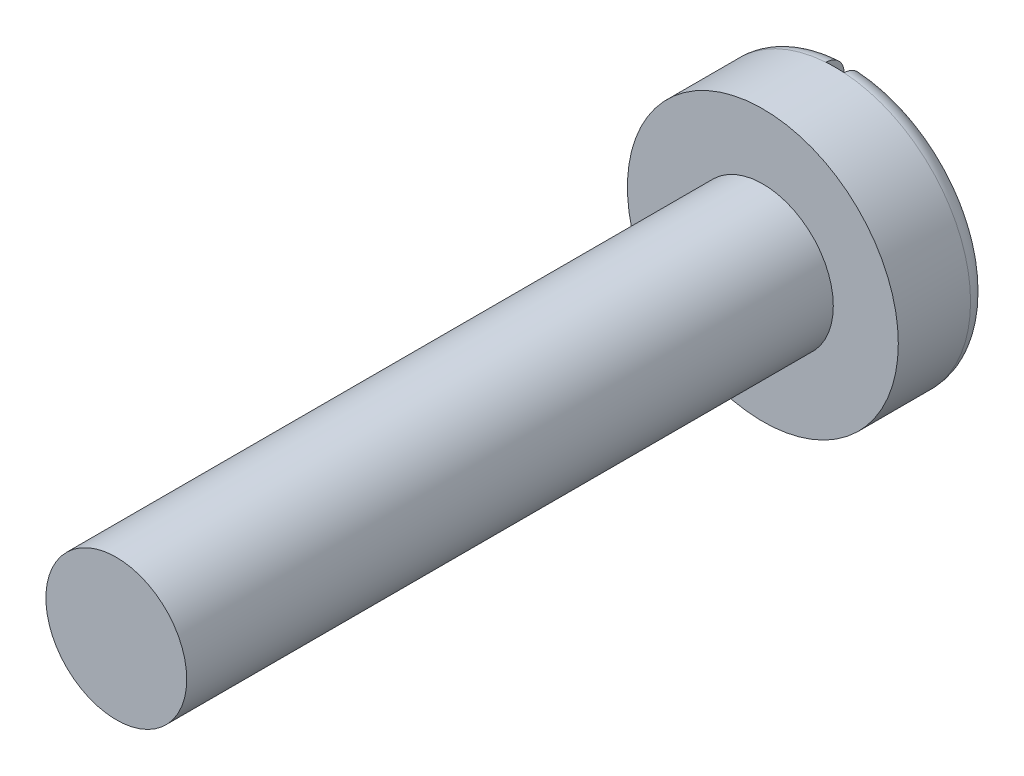
ISO-10303-21;
HEADER;
FILE_DESCRIPTION(('STEP AP214'),'2;1');
FILE_NAME('part.step','',(''),(''),'','','');
FILE_SCHEMA(('AUTOMOTIVE_DESIGN { 1 0 10303 214 1 1 1 1 }'));
ENDSEC;
DATA;
#1=APPLICATION_CONTEXT('core data for automotive mechanical design processes');
#2=APPLICATION_PROTOCOL_DEFINITION('international standard','automotive_design',2000,#1);
#3=PRODUCT_CONTEXT('',#1,'mechanical');
#4=PRODUCT('Part','Part','',(#3));
#5=PRODUCT_RELATED_PRODUCT_CATEGORY('part','',(#4));
#6=PRODUCT_DEFINITION_FORMATION('','',#4);
#7=PRODUCT_DEFINITION_CONTEXT('part definition',#1,'design');
#8=PRODUCT_DEFINITION('design','',#6,#7);
#9=PRODUCT_DEFINITION_SHAPE('','',#8);
#10=(LENGTH_UNIT() NAMED_UNIT(*) SI_UNIT(.MILLI.,.METRE.));
#11=(NAMED_UNIT(*) PLANE_ANGLE_UNIT() SI_UNIT($,.RADIAN.));
#12=(NAMED_UNIT(*) SI_UNIT($,.STERADIAN.) SOLID_ANGLE_UNIT());
#13=UNCERTAINTY_MEASURE_WITH_UNIT(LENGTH_MEASURE(1.E-05),#10,'distance_accuracy_value','');
#14=(GEOMETRIC_REPRESENTATION_CONTEXT(3) GLOBAL_UNCERTAINTY_ASSIGNED_CONTEXT((#13)) GLOBAL_UNIT_ASSIGNED_CONTEXT((#10,
#11,#12)) REPRESENTATION_CONTEXT('',''));
#15=CARTESIAN_POINT('',(0.,0.,0.));
#16=DIRECTION('',(0.,0.,1.));
#17=DIRECTION('',(1.,0.,0.));
#18=AXIS2_PLACEMENT_3D('',#15,#16,#17);
#19=CARTESIAN_POINT('',(0.,0.,55.));
#20=DIRECTION('',(0.,0.,1.));
#21=DIRECTION('',(1.,0.,0.));
#22=AXIS2_PLACEMENT_3D('',#19,#20,#21);
#23=CYLINDRICAL_SURFACE('',#22,1.905);
#24=CARTESIAN_POINT('',(0.,0.,0.));
#25=DIRECTION('',(0.,0.,1.));
#26=DIRECTION('',(1.,0.,0.));
#27=AXIS2_PLACEMENT_3D('',#24,#25,#26);
#28=CIRCLE('',#27,1.905);
#29=CARTESIAN_POINT('',(1.905,0.,0.));
#30=VERTEX_POINT('',#29);
#31=EDGE_CURVE('E102',#30,#30,#28,.T.);
#32=ORIENTED_EDGE('',*,*,#31,.F.);
#33=EDGE_LOOP('',(#32));
#34=FACE_BOUND('',#33,.T.);
#35=CARTESIAN_POINT('',(0.,0.,-1.016));
#36=DIRECTION('',(0.,0.,-1.));
#37=DIRECTION('',(-1.,0.,0.));
#38=AXIS2_PLACEMENT_3D('',#35,#36,#37);
#39=CIRCLE('',#38,1.905);
#40=CARTESIAN_POINT('',(-0.127,1.90076195248116,-1.016));
#41=VERTEX_POINT('',#40);
#42=CARTESIAN_POINT('',(0.127,1.90076195248116,-1.016));
#43=VERTEX_POINT('',#42);
#44=EDGE_CURVE('E81',#41,#43,#39,.T.);
#45=ORIENTED_EDGE('',*,*,#44,.F.);
#46=CARTESIAN_POINT('',(0.,0.,-1.016));
#47=DIRECTION('',(0.,0.,1.));
#48=DIRECTION('',(1.,0.,0.));
#49=AXIS2_PLACEMENT_3D('',#46,#47,#48);
#50=CIRCLE('',#49,1.905);
#51=CARTESIAN_POINT('',(-0.127,-1.90076195248116,-1.016));
#52=VERTEX_POINT('',#51);
#53=EDGE_CURVE('E85',#41,#52,#50,.T.);
#54=ORIENTED_EDGE('',*,*,#53,.T.);
#55=CARTESIAN_POINT('',(0.127,-1.90076195248116,-1.016));
#56=VERTEX_POINT('',#55);
#57=EDGE_CURVE('E84',#56,#52,#39,.T.);
#58=ORIENTED_EDGE('',*,*,#57,.F.);
#59=CARTESIAN_POINT('',(0.,0.,-1.016));
#60=DIRECTION('',(0.,0.,1.));
#61=DIRECTION('',(1.,0.,0.));
#62=AXIS2_PLACEMENT_3D('',#59,#60,#61);
#63=CIRCLE('',#62,1.905);
#64=EDGE_CURVE('E74',#56,#43,#63,.T.);
#65=ORIENTED_EDGE('',*,*,#64,.T.);
#66=EDGE_LOOP('',(#45,#54,#58,#65));
#67=FACE_BOUND('',#66,.T.);
#68=ADVANCED_FACE('F34',(#34,#67),#23,.T.);
#69=CARTESIAN_POINT('',(0.,1.905,-1.27));
#70=DIRECTION('',(0.,0.,1.));
#71=DIRECTION('',(1.,0.,0.));
#72=AXIS2_PLACEMENT_3D('',#69,#70,#71);
#73=PLANE('',#72);
#74=DIRECTION('',(0.,-1.,0.));
#75=VECTOR('',#74,1.);
#76=CARTESIAN_POINT('',(-0.127,0.,-1.27));
#77=LINE('',#76,#75);
#78=CARTESIAN_POINT('',(-0.127,1.6461081373956,-1.27));
#79=VERTEX_POINT('',#78);
#80=CARTESIAN_POINT('',(-0.127,-1.6461081373956,-1.27));
#81=VERTEX_POINT('',#80);
#82=EDGE_CURVE('E97',#79,#81,#77,.T.);
#83=ORIENTED_EDGE('',*,*,#82,.T.);
#84=CARTESIAN_POINT('',(0.,0.,-1.27));
#85=DIRECTION('',(0.,0.,1.));
#86=DIRECTION('',(1.,0.,0.));
#87=AXIS2_PLACEMENT_3D('',#84,#85,#86);
#88=CIRCLE('',#87,1.651);
#89=EDGE_CURVE('E168',#81,#79,#88,.F.);
#90=ORIENTED_EDGE('',*,*,#89,.T.);
#91=EDGE_LOOP('',(#83,#90));
#92=FACE_BOUND('',#91,.T.);
#93=ADVANCED_FACE('F142',(#92),#73,.F.);
#94=CARTESIAN_POINT('',(0.,0.990599999999999,9.0932));
#95=DIRECTION('',(0.,0.,-1.));
#96=DIRECTION('',(-1.,0.,0.));
#97=AXIS2_PLACEMENT_3D('',#94,#95,#96);
#98=PLANE('',#97);
#99=CARTESIAN_POINT('',(0.,0.,9.0932));
#100=DIRECTION('',(0.,0.,1.));
#101=DIRECTION('',(1.,0.,0.));
#102=AXIS2_PLACEMENT_3D('',#99,#100,#101);
#103=CIRCLE('',#102,0.990599999999999);
#104=CARTESIAN_POINT('',(0.990599999999999,0.,9.0932));
#105=VERTEX_POINT('',#104);
#106=EDGE_CURVE('E86',#105,#105,#103,.T.);
#107=ORIENTED_EDGE('',*,*,#106,.T.);
#108=EDGE_LOOP('',(#107));
#109=FACE_BOUND('',#108,.T.);
#110=ADVANCED_FACE('F137',(#109),#98,.F.);
#111=CARTESIAN_POINT('',(0.,0.,55.));
#112=DIRECTION('',(0.,0.,1.));
#113=DIRECTION('',(1.,0.,0.));
#114=AXIS2_PLACEMENT_3D('',#111,#112,#113);
#115=CYLINDRICAL_SURFACE('',#114,0.990599999999999);
#116=ORIENTED_EDGE('',*,*,#106,.F.);
#117=EDGE_LOOP('',(#116));
#118=FACE_BOUND('',#117,.T.);
#119=CARTESIAN_POINT('',(0.,0.,0.));
#120=DIRECTION('',(0.,0.,1.));
#121=DIRECTION('',(1.,0.,0.));
#122=AXIS2_PLACEMENT_3D('',#119,#120,#121);
#123=CIRCLE('',#122,0.9906);
#124=CARTESIAN_POINT('',(0.9906,0.,0.));
#125=VERTEX_POINT('',#124);
#126=EDGE_CURVE('E106',#125,#125,#123,.T.);
#127=ORIENTED_EDGE('',*,*,#126,.T.);
#128=EDGE_LOOP('',(#127));
#129=FACE_BOUND('',#128,.T.);
#130=ADVANCED_FACE('F141',(#118,#129),#115,.T.);
#131=CARTESIAN_POINT('',(0.,1.905,0.));
#132=DIRECTION('',(0.,0.,-1.));
#133=DIRECTION('',(-1.,0.,0.));
#134=AXIS2_PLACEMENT_3D('',#131,#132,#133);
#135=PLANE('',#134);
#136=ORIENTED_EDGE('',*,*,#126,.F.);
#137=EDGE_LOOP('',(#136));
#138=FACE_BOUND('',#137,.T.);
#139=ORIENTED_EDGE('',*,*,#31,.T.);
#140=EDGE_LOOP('',(#139));
#141=FACE_BOUND('',#140,.T.);
#142=ADVANCED_FACE('F146',(#138,#141),#135,.F.);
#143=DIRECTION('',(0.,-1.,0.));
#144=VECTOR('',#143,1.);
#145=CARTESIAN_POINT('',(0.127,0.,-1.27));
#146=LINE('',#145,#144);
#147=CARTESIAN_POINT('',(0.127,1.6461081373956,-1.27));
#148=VERTEX_POINT('',#147);
#149=CARTESIAN_POINT('',(0.127,-1.6461081373956,-1.27));
#150=VERTEX_POINT('',#149);
#151=EDGE_CURVE('E100',#148,#150,#146,.T.);
#152=ORIENTED_EDGE('',*,*,#151,.F.);
#153=CARTESIAN_POINT('',(0.,0.,-1.27));
#154=DIRECTION('',(0.,0.,1.));
#155=DIRECTION('',(1.,0.,0.));
#156=AXIS2_PLACEMENT_3D('',#153,#154,#155);
#157=CIRCLE('',#156,1.651);
#158=EDGE_CURVE('E11',#148,#150,#157,.F.);
#159=ORIENTED_EDGE('',*,*,#158,.T.);
#160=EDGE_LOOP('',(#152,#159));
#161=FACE_BOUND('',#160,.T.);
#162=ADVANCED_FACE('F150',(#161),#73,.F.);
#163=CARTESIAN_POINT('',(-0.127,0.,-1.016));
#164=DIRECTION('',(1.,0.,0.));
#165=DIRECTION('',(0.,0.,-1.));
#166=AXIS2_PLACEMENT_3D('',#163,#164,#165);
#167=PLANE('',#166);
#168=DIRECTION('',(0.,-1.,0.));
#169=VECTOR('',#168,1.);
#170=CARTESIAN_POINT('',(-0.127,0.,-1.016));
#171=LINE('',#170,#169);
#172=EDGE_CURVE('E96',#41,#52,#171,.T.);
#173=ORIENTED_EDGE('',*,*,#172,.T.);
#174=CARTESIAN_POINT('',(-0.127,-1.90076195248116,-1.016));
#175=CARTESIAN_POINT('',(-0.127,-1.90077420548945,-1.03026562544904));
#176=CARTESIAN_POINT('',(-0.127,-1.89955819235538,-1.04452745945829));
#177=CARTESIAN_POINT('',(-0.127,-1.89476024381098,-1.07263564534562));
#178=CARTESIAN_POINT('',(-0.127,-1.8911803027391,-1.08648233717498));
#179=CARTESIAN_POINT('',(-0.127,-1.88174265307725,-1.11338391508229));
#180=CARTESIAN_POINT('',(-0.127,-1.87588389473417,-1.12643843303128));
#181=CARTESIAN_POINT('',(-0.127,-1.86206152779824,-1.15137784491358));
#182=CARTESIAN_POINT('',(-0.127,-1.85409825656604,-1.16326292589299));
#183=CARTESIAN_POINT('',(-0.127,-1.83628495548849,-1.18554061816827));
#184=CARTESIAN_POINT('',(-0.127,-1.82643325024914,-1.19593188974203));
#185=CARTESIAN_POINT('',(-0.127,-1.80512627239349,-1.21491927781837));
#186=CARTESIAN_POINT('',(-0.127,-1.79367068432199,-1.22351504034549));
#187=CARTESIAN_POINT('',(-0.127,-1.76945591831009,-1.23868610901529));
#188=CARTESIAN_POINT('',(-0.127,-1.75669376785118,-1.24525666520417));
#189=CARTESIAN_POINT('',(-0.127,-1.73025169416702,-1.25616474263574));
#190=CARTESIAN_POINT('',(-0.127,-1.71657227312367,-1.26050347464249));
#191=CARTESIAN_POINT('',(-0.127,-1.69336214721708,-1.26577196168292));
#192=CARTESIAN_POINT('',(-0.127,-1.68397479147604,-1.26735660834129));
#193=CARTESIAN_POINT('',(-0.127,-1.66509560553012,-1.26947050304372));
#194=CARTESIAN_POINT('',(-0.127,-1.65560394382737,-1.27000125632662));
#195=CARTESIAN_POINT('',(-0.127,-1.6461081373959,-1.27000000000135));
#196=B_SPLINE_CURVE_WITH_KNOTS('',3,(#174,#175,#176,#177,#178,#179,#180,#181,#182,#183,#184,
#185,#186,#187,#188,#189,#190,#191,#192,#193,#194,#195),.UNSPECIFIED.,.F.,.F.,(4,2,2,2,2,2,2,2,
2,2,4),(0.,0.0427396779473607,0.0854433443623842,0.128166705862062,0.170883222809471,
0.213637814178934,0.25640082645913,0.29926338575801,0.34210266754061,0.370607921996298,
0.399072434030781),.UNSPECIFIED.);
#197=EDGE_CURVE('E122',#52,#81,#196,.T.);
#198=ORIENTED_EDGE('',*,*,#197,.T.);
#199=ORIENTED_EDGE('',*,*,#82,.F.);
#200=CARTESIAN_POINT('',(-0.127,1.6461081373956,-1.27));
#201=CARTESIAN_POINT('',(-0.127,1.66046341408676,-1.27001205642489));
#202=CARTESIAN_POINT('',(-0.127,1.67481546470729,-1.26879093943889));
#203=CARTESIAN_POINT('',(-0.127,1.70310455931541,-1.26396971764651));
#204=CARTESIAN_POINT('',(-0.127,1.71704188260949,-1.2603712536276));
#205=CARTESIAN_POINT('',(-0.127,1.744120971695,-1.2508799840151));
#206=CARTESIAN_POINT('',(-0.127,1.75726231576698,-1.24498597428955));
#207=CARTESIAN_POINT('',(-0.127,1.7823643372761,-1.2310738476685));
#208=CARTESIAN_POINT('',(-0.127,1.79432525769879,-1.22305616917889));
#209=CARTESIAN_POINT('',(-0.127,1.81670868297419,-1.20513560615357));
#210=CARTESIAN_POINT('',(-0.127,1.82713360275823,-1.19523573820479));
#211=CARTESIAN_POINT('',(-0.127,1.84617058490362,-1.17382011565835));
#212=CARTESIAN_POINT('',(-0.127,1.85478229752695,-1.16230405003517));
#213=CARTESIAN_POINT('',(-0.127,1.86992466463746,-1.13801430359242));
#214=CARTESIAN_POINT('',(-0.127,1.87645998322132,-1.12524352693912));
#215=CARTESIAN_POINT('',(-0.127,1.88728551816203,-1.09878723281334));
#216=CARTESIAN_POINT('',(-0.127,1.89157712406936,-1.08510228743056));
#217=CARTESIAN_POINT('',(-0.127,1.89670535788062,-1.06210858317353));
#218=CARTESIAN_POINT('',(-0.127,1.89822567537391,-1.0529465243326));
#219=CARTESIAN_POINT('',(-0.127,1.90025381604283,-1.03452427938172));
#220=CARTESIAN_POINT('',(-0.127,1.90076308020771,-1.0252642518646));
#221=CARTESIAN_POINT('',(-0.127,1.90076195248226,-1.01600000000025));
#222=B_SPLINE_CURVE_WITH_KNOTS('',3,(#200,#201,#202,#203,#204,#205,#206,#207,#208,#209,#210,
#211,#212,#213,#214,#215,#216,#217,#218,#219,#220,#221),.UNSPECIFIED.,.F.,.F.,(4,2,2,2,2,2,2,2,
2,2,4),(0.,0.043009408963126,0.0859891648386896,0.128991496240446,0.171984957237337,
0.214910084736852,0.25784348422209,0.300679751406985,0.343489458204936,0.371299661848379,
0.399070200861597),.UNSPECIFIED.);
#223=EDGE_CURVE('E115',#79,#41,#222,.T.);
#224=ORIENTED_EDGE('',*,*,#223,.T.);
#225=EDGE_LOOP('',(#173,#198,#199,#224));
#226=FACE_BOUND('',#225,.T.);
#227=ADVANCED_FACE('F128',(#226),#167,.T.);
#228=CARTESIAN_POINT('',(0.127,0.,-1.016));
#229=DIRECTION('',(1.,0.,0.));
#230=DIRECTION('',(0.,0.,-1.));
#231=AXIS2_PLACEMENT_3D('',#228,#229,#230);
#232=PLANE('',#231);
#233=DIRECTION('',(0.,-1.,0.));
#234=VECTOR('',#233,1.);
#235=CARTESIAN_POINT('',(0.127,0.,-1.016));
#236=LINE('',#235,#234);
#237=EDGE_CURVE('E89',#43,#56,#236,.T.);
#238=ORIENTED_EDGE('',*,*,#237,.F.);
#239=CARTESIAN_POINT('',(0.127,1.90076195248116,-1.016));
#240=CARTESIAN_POINT('',(0.127,1.90077420548945,-1.03026562544904));
#241=CARTESIAN_POINT('',(0.127,1.89955819235538,-1.04452745945829));
#242=CARTESIAN_POINT('',(0.127,1.89476024381098,-1.07263564534562));
#243=CARTESIAN_POINT('',(0.127,1.8911803027391,-1.08648233717498));
#244=CARTESIAN_POINT('',(0.127,1.88174265307725,-1.11338391508229));
#245=CARTESIAN_POINT('',(0.127,1.87588389473417,-1.12643843303128));
#246=CARTESIAN_POINT('',(0.127,1.86206152779824,-1.15137784491358));
#247=CARTESIAN_POINT('',(0.127,1.85409825656604,-1.16326292589299));
#248=CARTESIAN_POINT('',(0.127,1.83628495548849,-1.18554061816827));
#249=CARTESIAN_POINT('',(0.127,1.82643325024914,-1.19593188974203));
#250=CARTESIAN_POINT('',(0.127,1.80512627239349,-1.21491927781837));
#251=CARTESIAN_POINT('',(0.127,1.79367068432199,-1.22351504034549));
#252=CARTESIAN_POINT('',(0.127,1.76945591831009,-1.23868610901529));
#253=CARTESIAN_POINT('',(0.127,1.75669376785118,-1.24525666520417));
#254=CARTESIAN_POINT('',(0.127,1.73025169416702,-1.25616474263574));
#255=CARTESIAN_POINT('',(0.127,1.71657227312367,-1.26050347464249));
#256=CARTESIAN_POINT('',(0.127,1.69336214721708,-1.26577196168292));
#257=CARTESIAN_POINT('',(0.127,1.68397479147604,-1.26735660834129));
#258=CARTESIAN_POINT('',(0.127,1.66509560553012,-1.26947050304372));
#259=CARTESIAN_POINT('',(0.127,1.65560394382737,-1.27000125632662));
#260=CARTESIAN_POINT('',(0.127,1.6461081373959,-1.27000000000135));
#261=B_SPLINE_CURVE_WITH_KNOTS('',3,(#239,#240,#241,#242,#243,#244,#245,#246,#247,#248,#249,
#250,#251,#252,#253,#254,#255,#256,#257,#258,#259,#260),.UNSPECIFIED.,.F.,.F.,(4,2,2,2,2,2,2,2,
2,2,4),(0.,0.0427396779473607,0.0854433443623842,0.128166705862062,0.170883222809471,
0.213637814178934,0.25640082645913,0.29926338575801,0.34210266754061,0.370607921996298,
0.399072434030781),.UNSPECIFIED.);
#262=EDGE_CURVE('E43',#43,#148,#261,.T.);
#263=ORIENTED_EDGE('',*,*,#262,.T.);
#264=ORIENTED_EDGE('',*,*,#151,.T.);
#265=CARTESIAN_POINT('',(0.127,-1.6461081373956,-1.27));
#266=CARTESIAN_POINT('',(0.127,-1.66046341408676,-1.27001205642489));
#267=CARTESIAN_POINT('',(0.127,-1.67481546470729,-1.26879093943889));
#268=CARTESIAN_POINT('',(0.127,-1.70310455931541,-1.26396971764651));
#269=CARTESIAN_POINT('',(0.127,-1.71704188260949,-1.2603712536276));
#270=CARTESIAN_POINT('',(0.127,-1.744120971695,-1.2508799840151));
#271=CARTESIAN_POINT('',(0.127,-1.75726231576698,-1.24498597428955));
#272=CARTESIAN_POINT('',(0.127,-1.7823643372761,-1.2310738476685));
#273=CARTESIAN_POINT('',(0.127,-1.79432525769879,-1.22305616917889));
#274=CARTESIAN_POINT('',(0.127,-1.81670868297419,-1.20513560615357));
#275=CARTESIAN_POINT('',(0.127,-1.82713360275823,-1.19523573820479));
#276=CARTESIAN_POINT('',(0.127,-1.84617058490362,-1.17382011565835));
#277=CARTESIAN_POINT('',(0.127,-1.85478229752695,-1.16230405003517));
#278=CARTESIAN_POINT('',(0.127,-1.86992466463746,-1.13801430359242));
#279=CARTESIAN_POINT('',(0.127,-1.87645998322132,-1.12524352693912));
#280=CARTESIAN_POINT('',(0.127,-1.88728551816203,-1.09878723281334));
#281=CARTESIAN_POINT('',(0.127,-1.89157712406936,-1.08510228743056));
#282=CARTESIAN_POINT('',(0.127,-1.89670535788062,-1.06210858317353));
#283=CARTESIAN_POINT('',(0.127,-1.89822567537391,-1.0529465243326));
#284=CARTESIAN_POINT('',(0.127,-1.90025381604283,-1.03452427938172));
#285=CARTESIAN_POINT('',(0.127,-1.90076308020771,-1.0252642518646));
#286=CARTESIAN_POINT('',(0.127,-1.90076195248226,-1.01600000000025));
#287=B_SPLINE_CURVE_WITH_KNOTS('',3,(#265,#266,#267,#268,#269,#270,#271,#272,#273,#274,#275,
#276,#277,#278,#279,#280,#281,#282,#283,#284,#285,#286),.UNSPECIFIED.,.F.,.F.,(4,2,2,2,2,2,2,2,
2,2,4),(0.,0.043009408963126,0.0859891648386896,0.128991496240446,0.171984957237337,
0.214910084736852,0.25784348422209,0.300679751406985,0.343489458204936,0.371299661848379,
0.399070200861597),.UNSPECIFIED.);
#288=EDGE_CURVE('E75',#150,#56,#287,.T.);
#289=ORIENTED_EDGE('',*,*,#288,.T.);
#290=EDGE_LOOP('',(#238,#263,#264,#289));
#291=FACE_BOUND('',#290,.T.);
#292=ADVANCED_FACE('F90',(#291),#232,.F.);
#293=CARTESIAN_POINT('',(0.,0.,-1.016));
#294=DIRECTION('',(0.,0.,-1.));
#295=DIRECTION('',(-1.,0.,0.));
#296=AXIS2_PLACEMENT_3D('',#293,#294,#295);
#297=PLANE('',#296);
#298=ORIENTED_EDGE('',*,*,#44,.T.);
#299=ORIENTED_EDGE('',*,*,#237,.T.);
#300=ORIENTED_EDGE('',*,*,#57,.T.);
#301=ORIENTED_EDGE('',*,*,#172,.F.);
#302=EDGE_LOOP('',(#298,#299,#300,#301));
#303=FACE_BOUND('',#302,.T.);
#304=ADVANCED_FACE('F94',(#303),#297,.T.);
#305=CARTESIAN_POINT('',(0.,0.,-1.016));
#306=DIRECTION('',(0.,0.,1.));
#307=DIRECTION('',(1.,0.,0.));
#308=AXIS2_PLACEMENT_3D('',#305,#306,#307);
#309=TOROIDAL_SURFACE('',#308,1.651,0.254);
#310=ORIENTED_EDGE('',*,*,#223,.F.);
#311=ORIENTED_EDGE('',*,*,#89,.F.);
#312=ORIENTED_EDGE('',*,*,#197,.F.);
#313=ORIENTED_EDGE('',*,*,#53,.F.);
#314=EDGE_LOOP('',(#310,#311,#312,#313));
#315=FACE_BOUND('',#314,.T.);
#316=ADVANCED_FACE('F132',(#315),#309,.T.);
#317=CARTESIAN_POINT('',(0.,0.,-1.016));
#318=DIRECTION('',(0.,0.,1.));
#319=DIRECTION('',(1.,0.,0.));
#320=AXIS2_PLACEMENT_3D('',#317,#318,#319);
#321=TOROIDAL_SURFACE('',#320,1.651,0.254);
#322=ORIENTED_EDGE('',*,*,#288,.F.);
#323=ORIENTED_EDGE('',*,*,#158,.F.);
#324=ORIENTED_EDGE('',*,*,#262,.F.);
#325=ORIENTED_EDGE('',*,*,#64,.F.);
#326=EDGE_LOOP('',(#322,#323,#324,#325));
#327=FACE_BOUND('',#326,.T.);
#328=ADVANCED_FACE('F36',(#327),#321,.T.);
#329=CLOSED_SHELL('',(#68,#93,#110,#130,#142,#162,#227,#292,#304,#316,#328));
#330=MANIFOLD_SOLID_BREP('B2',#329);
#331=ADVANCED_BREP_SHAPE_REPRESENTATION('',(#18,#330),#14);
#332=SHAPE_DEFINITION_REPRESENTATION(#9,#331);
ENDSEC;
END-ISO-10303-21;
